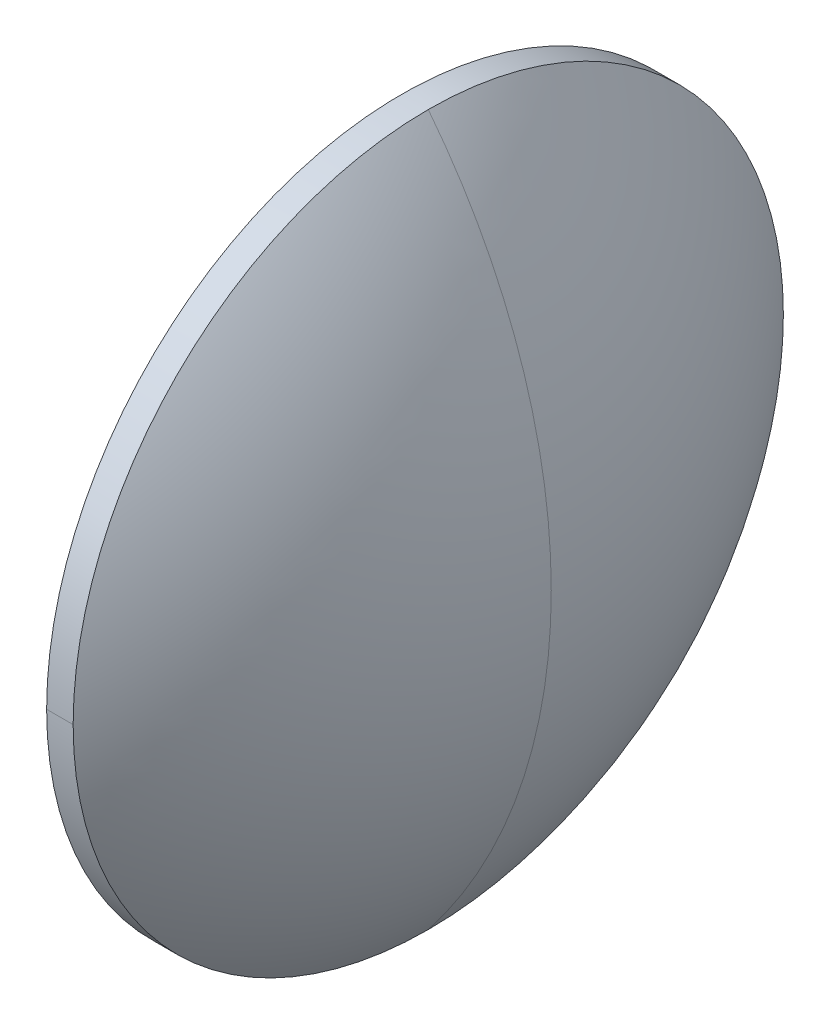
ISO-10303-21;
HEADER;
FILE_DESCRIPTION(('STEP AP214'),'2;1');
FILE_NAME('part.step','',(''),(''),'','','');
FILE_SCHEMA(('AUTOMOTIVE_DESIGN { 1 0 10303 214 1 1 1 1 }'));
ENDSEC;
DATA;
#1=APPLICATION_CONTEXT('core data for automotive mechanical design processes');
#2=APPLICATION_PROTOCOL_DEFINITION('international standard','automotive_design',2000,#1);
#3=PRODUCT_CONTEXT('',#1,'mechanical');
#4=PRODUCT('Part','Part','',(#3));
#5=PRODUCT_RELATED_PRODUCT_CATEGORY('part','',(#4));
#6=PRODUCT_DEFINITION_FORMATION('','',#4);
#7=PRODUCT_DEFINITION_CONTEXT('part definition',#1,'design');
#8=PRODUCT_DEFINITION('design','',#6,#7);
#9=PRODUCT_DEFINITION_SHAPE('','',#8);
#10=(LENGTH_UNIT() NAMED_UNIT(*) SI_UNIT(.MILLI.,.METRE.));
#11=(NAMED_UNIT(*) PLANE_ANGLE_UNIT() SI_UNIT($,.RADIAN.));
#12=(NAMED_UNIT(*) SI_UNIT($,.STERADIAN.) SOLID_ANGLE_UNIT());
#13=UNCERTAINTY_MEASURE_WITH_UNIT(LENGTH_MEASURE(1.E-05),#10,'distance_accuracy_value','');
#14=(GEOMETRIC_REPRESENTATION_CONTEXT(3) GLOBAL_UNCERTAINTY_ASSIGNED_CONTEXT((#13)) GLOBAL_UNIT_ASSIGNED_CONTEXT((#10,
#11,#12)) REPRESENTATION_CONTEXT('',''));
#15=CARTESIAN_POINT('',(0.,0.,0.));
#16=DIRECTION('',(0.,0.,1.));
#17=DIRECTION('',(1.,0.,0.));
#18=AXIS2_PLACEMENT_3D('',#15,#16,#17);
#19=CARTESIAN_POINT('',(2554.32334911374,-224.917697129705,0.));
#20=DIRECTION('',(-1.,0.,0.));
#21=DIRECTION('',(0.,0.,1.));
#22=AXIS2_PLACEMENT_3D('',#19,#20,#21);
#23=CYLINDRICAL_SURFACE('',#22,18.9999998694528);
#24=DIRECTION('',(-1.,0.,0.));
#25=VECTOR('',#24,1.);
#26=CARTESIAN_POINT('',(2554.32334911374,-224.917697129705,-18.9999998694528));
#27=LINE('',#26,#25);
#28=CARTESIAN_POINT('',(2562.5097127513,-224.917697129705,-18.9999998694528));
#29=VERTEX_POINT('',#28);
#30=CARTESIAN_POINT('',(2561.09079571004,-224.917697129705,-18.9999998694527));
#31=VERTEX_POINT('',#30);
#32=EDGE_CURVE('E83',#29,#31,#27,.T.);
#33=ORIENTED_EDGE('',*,*,#32,.F.);
#34=CARTESIAN_POINT('',(2562.5097127513,-224.917697129705,0.));
#35=DIRECTION('',(-1.,0.,0.));
#36=DIRECTION('',(0.,0.,1.));
#37=AXIS2_PLACEMENT_3D('',#34,#35,#36);
#38=CIRCLE('',#37,18.9999998694528);
#39=CARTESIAN_POINT('',(2562.5097127513,-243.917696999157,0.));
#40=VERTEX_POINT('',#39);
#41=EDGE_CURVE('E80',#29,#40,#38,.T.);
#42=ORIENTED_EDGE('',*,*,#41,.T.);
#43=CARTESIAN_POINT('',(2562.5097127513,-224.917697129705,0.));
#44=DIRECTION('',(-1.,0.,0.));
#45=DIRECTION('',(0.,0.,1.));
#46=AXIS2_PLACEMENT_3D('',#43,#44,#45);
#47=CIRCLE('',#46,18.9999998694528);
#48=CARTESIAN_POINT('',(2562.5097127513,-224.917697129705,18.9999998694528));
#49=VERTEX_POINT('',#48);
#50=EDGE_CURVE('E9',#40,#49,#47,.T.);
#51=ORIENTED_EDGE('',*,*,#50,.T.);
#52=DIRECTION('',(-1.,0.,0.));
#53=VECTOR('',#52,1.);
#54=CARTESIAN_POINT('',(2554.32334911374,-224.917697129705,18.9999998694528));
#55=LINE('',#54,#53);
#56=CARTESIAN_POINT('',(2561.09079571004,-224.917697129705,18.9999998694527));
#57=VERTEX_POINT('',#56);
#58=EDGE_CURVE('E19',#49,#57,#55,.T.);
#59=ORIENTED_EDGE('',*,*,#58,.T.);
#60=CARTESIAN_POINT('',(2561.09079571004,-224.917697129705,0.));
#61=DIRECTION('',(-1.,0.,0.));
#62=DIRECTION('',(0.,0.,1.));
#63=AXIS2_PLACEMENT_3D('',#60,#61,#62);
#64=CIRCLE('',#63,18.9999998694527);
#65=EDGE_CURVE('E26',#31,#57,#64,.T.);
#66=ORIENTED_EDGE('',*,*,#65,.F.);
#67=EDGE_LOOP('',(#33,#42,#51,#59,#66));
#68=FACE_BOUND('',#67,.T.);
#69=ADVANCED_FACE('F15',(#68),#23,.T.);
#70=CARTESIAN_POINT('',(2538.37315771004,-224.917697129705,0.));
#71=DIRECTION('',(0.,0.,-1.));
#72=DIRECTION('',(0.,1.,0.));
#73=AXIS2_PLACEMENT_3D('',#70,#71,#72);
#74=SPHERICAL_SURFACE('',#73,30.7176380000003);
#75=CARTESIAN_POINT('',(2538.37315771004,-224.917697129705,0.));
#76=DIRECTION('',(0.,0.,-1.));
#77=DIRECTION('',(0.,1.,0.));
#78=AXIS2_PLACEMENT_3D('',#75,#76,#77);
#79=CIRCLE('',#78,30.7176380000003);
#80=CARTESIAN_POINT('',(2569.09079571004,-224.917697129705,0.));
#81=VERTEX_POINT('',#80);
#82=EDGE_CURVE('E66',#81,#40,#79,.T.);
#83=ORIENTED_EDGE('',*,*,#82,.F.);
#84=CARTESIAN_POINT('',(2538.37315771004,-224.917697129705,0.));
#85=DIRECTION('',(0.,0.,1.));
#86=DIRECTION('',(1.,0.,0.));
#87=AXIS2_PLACEMENT_3D('',#84,#85,#86);
#88=CIRCLE('',#87,30.7176380000005);
#89=CARTESIAN_POINT('',(2562.5097127513,-205.917697260252,0.));
#90=VERTEX_POINT('',#89);
#91=EDGE_CURVE('E60',#81,#90,#88,.T.);
#92=ORIENTED_EDGE('',*,*,#91,.T.);
#93=CARTESIAN_POINT('',(2562.5097127513,-224.917697129705,0.));
#94=DIRECTION('',(-1.,0.,0.));
#95=DIRECTION('',(0.,0.,1.));
#96=AXIS2_PLACEMENT_3D('',#93,#94,#95);
#97=CIRCLE('',#96,18.9999998694528);
#98=EDGE_CURVE('E63',#49,#90,#97,.T.);
#99=ORIENTED_EDGE('',*,*,#98,.F.);
#100=ORIENTED_EDGE('',*,*,#50,.F.);
#101=EDGE_LOOP('',(#83,#92,#99,#100));
#102=FACE_BOUND('',#101,.T.);
#103=ADVANCED_FACE('F62',(#102),#74,.T.);
#104=CARTESIAN_POINT('',(2561.09079571004,0.,0.));
#105=DIRECTION('',(-1.,0.,0.));
#106=DIRECTION('',(0.,0.,1.));
#107=AXIS2_PLACEMENT_3D('',#104,#105,#106);
#108=PLANE('',#107);
#109=CARTESIAN_POINT('',(2561.09079571004,-224.917697129705,0.));
#110=DIRECTION('',(-1.,0.,0.));
#111=DIRECTION('',(0.,0.,1.));
#112=AXIS2_PLACEMENT_3D('',#109,#110,#111);
#113=CIRCLE('',#112,18.9999998694527);
#114=EDGE_CURVE('E89',#57,#31,#113,.T.);
#115=ORIENTED_EDGE('',*,*,#114,.T.);
#116=ORIENTED_EDGE('',*,*,#65,.T.);
#117=EDGE_LOOP('',(#115,#116));
#118=FACE_BOUND('',#117,.T.);
#119=ADVANCED_FACE('F151',(#118),#108,.T.);
#120=CARTESIAN_POINT('',(2538.37315771004,-224.917697129705,0.));
#121=DIRECTION('',(0.,0.,-1.));
#122=DIRECTION('',(0.,1.,0.));
#123=AXIS2_PLACEMENT_3D('',#120,#121,#122);
#124=SPHERICAL_SURFACE('',#123,30.7176380000003);
#125=ORIENTED_EDGE('',*,*,#91,.F.);
#126=ORIENTED_EDGE('',*,*,#82,.T.);
#127=ORIENTED_EDGE('',*,*,#41,.F.);
#128=CARTESIAN_POINT('',(2562.5097127513,-224.917697129705,0.));
#129=DIRECTION('',(-1.,0.,0.));
#130=DIRECTION('',(0.,0.,1.));
#131=AXIS2_PLACEMENT_3D('',#128,#129,#130);
#132=CIRCLE('',#131,18.9999998694528);
#133=EDGE_CURVE('E74',#90,#29,#132,.T.);
#134=ORIENTED_EDGE('',*,*,#133,.F.);
#135=EDGE_LOOP('',(#125,#126,#127,#134));
#136=FACE_BOUND('',#135,.T.);
#137=ADVANCED_FACE('F79',(#136),#124,.T.);
#138=CARTESIAN_POINT('',(2554.32334911374,-224.917697129705,0.));
#139=DIRECTION('',(-1.,0.,0.));
#140=DIRECTION('',(0.,0.,1.));
#141=AXIS2_PLACEMENT_3D('',#138,#139,#140);
#142=CYLINDRICAL_SURFACE('',#141,18.9999998694528);
#143=ORIENTED_EDGE('',*,*,#133,.T.);
#144=ORIENTED_EDGE('',*,*,#32,.T.);
#145=ORIENTED_EDGE('',*,*,#114,.F.);
#146=ORIENTED_EDGE('',*,*,#58,.F.);
#147=ORIENTED_EDGE('',*,*,#98,.T.);
#148=EDGE_LOOP('',(#143,#144,#145,#146,#147));
#149=FACE_BOUND('',#148,.T.);
#150=ADVANCED_FACE('F17',(#149),#142,.T.);
#151=CLOSED_SHELL('',(#69,#103,#119,#137,#150));
#152=MANIFOLD_SOLID_BREP('B1',#151);
#153=ADVANCED_BREP_SHAPE_REPRESENTATION('',(#18,#152),#14);
#154=SHAPE_DEFINITION_REPRESENTATION(#9,#153);
ENDSEC;
END-ISO-10303-21;
